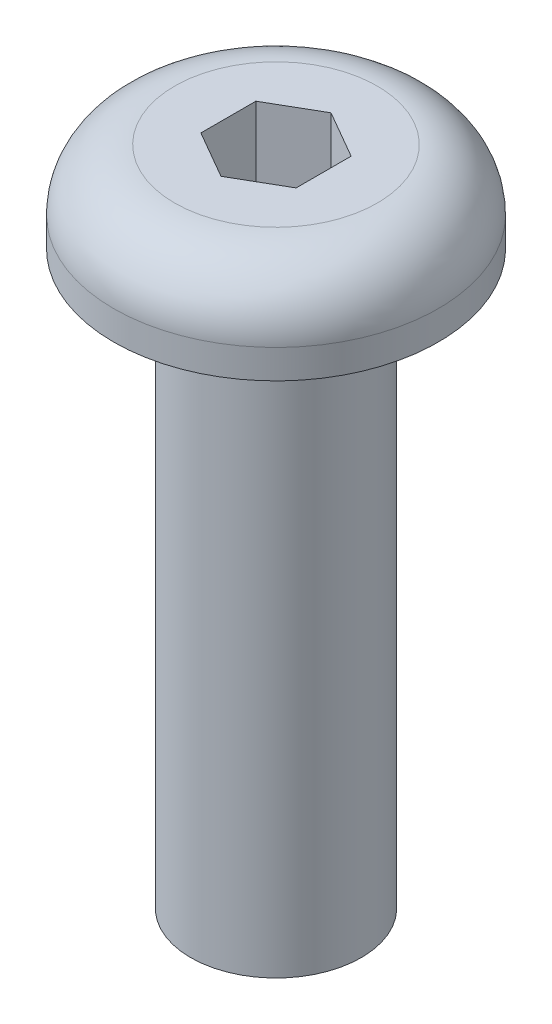
ISO-10303-21;
HEADER;
FILE_DESCRIPTION(('STEP AP214'),'2;1');
FILE_NAME('part.step','',(''),(''),'','','');
FILE_SCHEMA(('AUTOMOTIVE_DESIGN { 1 0 10303 214 1 1 1 1 }'));
ENDSEC;
DATA;
#1=APPLICATION_CONTEXT('core data for automotive mechanical design processes');
#2=APPLICATION_PROTOCOL_DEFINITION('international standard','automotive_design',2000,#1);
#3=PRODUCT_CONTEXT('',#1,'mechanical');
#4=PRODUCT('Part','Part','',(#3));
#5=PRODUCT_RELATED_PRODUCT_CATEGORY('part','',(#4));
#6=PRODUCT_DEFINITION_FORMATION('','',#4);
#7=PRODUCT_DEFINITION_CONTEXT('part definition',#1,'design');
#8=PRODUCT_DEFINITION('design','',#6,#7);
#9=PRODUCT_DEFINITION_SHAPE('','',#8);
#10=(LENGTH_UNIT() NAMED_UNIT(*) SI_UNIT(.MILLI.,.METRE.));
#11=(NAMED_UNIT(*) PLANE_ANGLE_UNIT() SI_UNIT($,.RADIAN.));
#12=(NAMED_UNIT(*) SI_UNIT($,.STERADIAN.) SOLID_ANGLE_UNIT());
#13=UNCERTAINTY_MEASURE_WITH_UNIT(LENGTH_MEASURE(1.E-05),#10,'distance_accuracy_value','');
#14=(GEOMETRIC_REPRESENTATION_CONTEXT(3) GLOBAL_UNCERTAINTY_ASSIGNED_CONTEXT((#13)) GLOBAL_UNIT_ASSIGNED_CONTEXT((#10,
#11,#12)) REPRESENTATION_CONTEXT('',''));
#15=CARTESIAN_POINT('',(0.,0.,0.));
#16=DIRECTION('',(0.,0.,1.));
#17=DIRECTION('',(1.,0.,0.));
#18=AXIS2_PLACEMENT_3D('',#15,#16,#17);
#19=CARTESIAN_POINT('',(0.,9.525,0.));
#20=DIRECTION('',(0.,-1.,0.));
#21=DIRECTION('',(0.,0.,-1.));
#22=AXIS2_PLACEMENT_3D('',#19,#20,#21);
#23=CYLINDRICAL_SURFACE('',#22,1.4224);
#24=CARTESIAN_POINT('',(0.,9.525,0.));
#25=DIRECTION('',(0.,1.,0.));
#26=DIRECTION('',(0.,0.,1.));
#27=AXIS2_PLACEMENT_3D('',#24,#25,#26);
#28=CIRCLE('',#27,1.4224);
#29=CARTESIAN_POINT('',(0.,9.525,1.4224));
#30=VERTEX_POINT('',#29);
#31=EDGE_CURVE('E143',#30,#30,#28,.T.);
#32=ORIENTED_EDGE('',*,*,#31,.F.);
#33=EDGE_LOOP('',(#32));
#34=FACE_BOUND('',#33,.T.);
#35=CARTESIAN_POINT('',(0.,0.,0.));
#36=DIRECTION('',(0.,1.,0.));
#37=DIRECTION('',(0.,0.,1.));
#38=AXIS2_PLACEMENT_3D('',#35,#36,#37);
#39=CIRCLE('',#38,1.4224);
#40=CARTESIAN_POINT('',(0.,0.,1.4224));
#41=VERTEX_POINT('',#40);
#42=EDGE_CURVE('E142',#41,#41,#39,.T.);
#43=ORIENTED_EDGE('',*,*,#42,.T.);
#44=EDGE_LOOP('',(#43));
#45=FACE_BOUND('',#44,.T.);
#46=ADVANCED_FACE('F32',(#34,#45),#23,.T.);
#47=CARTESIAN_POINT('',(0.,0.,0.));
#48=DIRECTION('',(0.,1.,0.));
#49=DIRECTION('',(0.,0.,1.));
#50=AXIS2_PLACEMENT_3D('',#47,#48,#49);
#51=PLANE('',#50);
#52=ORIENTED_EDGE('',*,*,#42,.F.);
#53=EDGE_LOOP('',(#52));
#54=FACE_BOUND('',#53,.T.);
#55=ADVANCED_FACE('F166',(#54),#51,.F.);
#56=CARTESIAN_POINT('',(0.,9.525,0.));
#57=DIRECTION('',(0.,1.,0.));
#58=DIRECTION('',(0.,0.,1.));
#59=AXIS2_PLACEMENT_3D('',#56,#57,#58);
#60=PLANE('',#59);
#61=CARTESIAN_POINT('',(0.,9.525,0.));
#62=DIRECTION('',(0.,1.,0.));
#63=DIRECTION('',(0.,0.,1.));
#64=AXIS2_PLACEMENT_3D('',#61,#62,#63);
#65=CIRCLE('',#64,2.7051);
#66=CARTESIAN_POINT('',(0.,9.525,2.7051));
#67=VERTEX_POINT('',#66);
#68=EDGE_CURVE('E134',#67,#67,#65,.T.);
#69=ORIENTED_EDGE('',*,*,#68,.F.);
#70=EDGE_LOOP('',(#69));
#71=FACE_BOUND('',#70,.T.);
#72=ORIENTED_EDGE('',*,*,#31,.T.);
#73=EDGE_LOOP('',(#72));
#74=FACE_BOUND('',#73,.T.);
#75=ADVANCED_FACE('F171',(#71,#74),#60,.F.);
#76=CARTESIAN_POINT('',(0.,11.0236,0.));
#77=DIRECTION('',(0.,-1.,0.));
#78=DIRECTION('',(0.,0.,-1.));
#79=AXIS2_PLACEMENT_3D('',#76,#77,#78);
#80=CYLINDRICAL_SURFACE('',#79,2.7051);
#81=CARTESIAN_POINT('',(0.,10.0076,0.));
#82=DIRECTION('',(0.,1.,0.));
#83=DIRECTION('',(0.,0.,1.));
#84=AXIS2_PLACEMENT_3D('',#81,#82,#83);
#85=CIRCLE('',#84,2.7051);
#86=CARTESIAN_POINT('',(0.,10.0076,2.7051));
#87=VERTEX_POINT('',#86);
#88=EDGE_CURVE('E11',#87,#87,#85,.F.);
#89=ORIENTED_EDGE('',*,*,#88,.T.);
#90=EDGE_LOOP('',(#89));
#91=FACE_BOUND('',#90,.T.);
#92=ORIENTED_EDGE('',*,*,#68,.T.);
#93=EDGE_LOOP('',(#92));
#94=FACE_BOUND('',#93,.T.);
#95=ADVANCED_FACE('F161',(#91,#94),#80,.T.);
#96=CARTESIAN_POINT('',(0.,11.0236,0.));
#97=DIRECTION('',(0.,1.,0.));
#98=DIRECTION('',(0.,0.,1.));
#99=AXIS2_PLACEMENT_3D('',#96,#97,#98);
#100=PLANE('',#99);
#101=DIRECTION('',(-0.866025403784438,0.,-0.5));
#102=VECTOR('',#101,1.);
#103=CARTESIAN_POINT('',(0.79375,11.0236,-0.458271776169266));
#104=LINE('',#103,#102);
#105=CARTESIAN_POINT('',(0.79375,11.0236,-0.458271776169266));
#106=VERTEX_POINT('',#105);
#107=CARTESIAN_POINT('',(0.,11.0236,-0.916543552338531));
#108=VERTEX_POINT('',#107);
#109=EDGE_CURVE('E47',#106,#108,#104,.T.);
#110=ORIENTED_EDGE('',*,*,#109,.F.);
#111=DIRECTION('',(0.,0.,-1.));
#112=VECTOR('',#111,1.);
#113=CARTESIAN_POINT('',(0.79375,11.0236,0.458271776169266));
#114=LINE('',#113,#112);
#115=CARTESIAN_POINT('',(0.79375,11.0236,0.458271776169266));
#116=VERTEX_POINT('',#115);
#117=EDGE_CURVE('E130',#116,#106,#114,.T.);
#118=ORIENTED_EDGE('',*,*,#117,.F.);
#119=DIRECTION('',(0.866025403784439,0.,-0.5));
#120=VECTOR('',#119,1.);
#121=CARTESIAN_POINT('',(0.,11.0236,0.916543552338531));
#122=LINE('',#121,#120);
#123=CARTESIAN_POINT('',(0.,11.0236,0.916543552338531));
#124=VERTEX_POINT('',#123);
#125=EDGE_CURVE('E128',#124,#116,#122,.T.);
#126=ORIENTED_EDGE('',*,*,#125,.F.);
#127=DIRECTION('',(0.866025403784439,0.,0.5));
#128=VECTOR('',#127,1.);
#129=CARTESIAN_POINT('',(-0.79375,11.0236,0.458271776169265));
#130=LINE('',#129,#128);
#131=CARTESIAN_POINT('',(-0.79375,11.0236,0.458271776169265));
#132=VERTEX_POINT('',#131);
#133=EDGE_CURVE('E95',#132,#124,#130,.T.);
#134=ORIENTED_EDGE('',*,*,#133,.F.);
#135=DIRECTION('',(0.,0.,1.));
#136=VECTOR('',#135,1.);
#137=CARTESIAN_POINT('',(-0.79375,11.0236,-0.458271776169265));
#138=LINE('',#137,#136);
#139=CARTESIAN_POINT('',(-0.79375,11.0236,-0.458271776169265));
#140=VERTEX_POINT('',#139);
#141=EDGE_CURVE('E124',#140,#132,#138,.T.);
#142=ORIENTED_EDGE('',*,*,#141,.F.);
#143=DIRECTION('',(-0.866025403784438,0.,0.5));
#144=VECTOR('',#143,1.);
#145=CARTESIAN_POINT('',(0.,11.0236,-0.916543552338531));
#146=LINE('',#145,#144);
#147=EDGE_CURVE('E121',#108,#140,#146,.T.);
#148=ORIENTED_EDGE('',*,*,#147,.F.);
#149=EDGE_LOOP('',(#110,#118,#126,#134,#142,#148));
#150=FACE_BOUND('',#149,.T.);
#151=CARTESIAN_POINT('',(0.,11.0236,0.));
#152=DIRECTION('',(0.,1.,0.));
#153=DIRECTION('',(0.,0.,1.));
#154=AXIS2_PLACEMENT_3D('',#151,#152,#153);
#155=CIRCLE('',#154,1.6891);
#156=CARTESIAN_POINT('',(0.,11.0236,1.6891));
#157=VERTEX_POINT('',#156);
#158=EDGE_CURVE('E40',#157,#157,#155,.T.);
#159=ORIENTED_EDGE('',*,*,#158,.T.);
#160=EDGE_LOOP('',(#159));
#161=FACE_BOUND('',#160,.T.);
#162=ADVANCED_FACE('F150',(#150,#161),#100,.T.);
#163=CARTESIAN_POINT('',(0.,10.0076,0.));
#164=DIRECTION('',(0.,1.,0.));
#165=DIRECTION('',(0.,0.,1.));
#166=AXIS2_PLACEMENT_3D('',#163,#164,#165);
#167=TOROIDAL_SURFACE('',#166,1.6891,1.016);
#168=ORIENTED_EDGE('',*,*,#88,.F.);
#169=EDGE_LOOP('',(#168));
#170=FACE_BOUND('',#169,.T.);
#171=ORIENTED_EDGE('',*,*,#158,.F.);
#172=EDGE_LOOP('',(#171));
#173=FACE_BOUND('',#172,.T.);
#174=ADVANCED_FACE('F34',(#170,#173),#167,.T.);
#175=CARTESIAN_POINT('',(0.79375,8.64235,-0.458271776169266));
#176=DIRECTION('',(0.5,0.,-0.866025403784439));
#177=DIRECTION('',(-0.866025403784438,0.,-0.5));
#178=AXIS2_PLACEMENT_3D('',#175,#176,#177);
#179=PLANE('',#178);
#180=ORIENTED_EDGE('',*,*,#109,.T.);
#181=DIRECTION('',(0.,1.,0.));
#182=VECTOR('',#181,1.);
#183=CARTESIAN_POINT('',(0.,8.64235,-0.916543552338531));
#184=LINE('',#183,#182);
#185=CARTESIAN_POINT('',(0.,8.64235,-0.916543552338531));
#186=VERTEX_POINT('',#185);
#187=EDGE_CURVE('E77',#186,#108,#184,.T.);
#188=ORIENTED_EDGE('',*,*,#187,.F.);
#189=DIRECTION('',(-0.866025403784438,0.,-0.5));
#190=VECTOR('',#189,1.);
#191=CARTESIAN_POINT('',(0.79375,8.64235,-0.458271776169266));
#192=LINE('',#191,#190);
#193=CARTESIAN_POINT('',(0.79375,8.64235,-0.458271776169266));
#194=VERTEX_POINT('',#193);
#195=EDGE_CURVE('E132',#194,#186,#192,.T.);
#196=ORIENTED_EDGE('',*,*,#195,.F.);
#197=DIRECTION('',(0.,1.,0.));
#198=VECTOR('',#197,1.);
#199=CARTESIAN_POINT('',(0.79375,8.64235,-0.458271776169266));
#200=LINE('',#199,#198);
#201=EDGE_CURVE('E55',#194,#106,#200,.T.);
#202=ORIENTED_EDGE('',*,*,#201,.T.);
#203=EDGE_LOOP('',(#180,#188,#196,#202));
#204=FACE_BOUND('',#203,.T.);
#205=ADVANCED_FACE('F153',(#204),#179,.F.);
#206=CARTESIAN_POINT('',(0.79375,8.64235,0.458271776169266));
#207=DIRECTION('',(1.,0.,0.));
#208=DIRECTION('',(0.,0.,-1.));
#209=AXIS2_PLACEMENT_3D('',#206,#207,#208);
#210=PLANE('',#209);
#211=ORIENTED_EDGE('',*,*,#117,.T.);
#212=ORIENTED_EDGE('',*,*,#201,.F.);
#213=DIRECTION('',(0.,0.,-1.));
#214=VECTOR('',#213,1.);
#215=CARTESIAN_POINT('',(0.79375,8.64235,0.458271776169266));
#216=LINE('',#215,#214);
#217=CARTESIAN_POINT('',(0.79375,8.64235,0.458271776169266));
#218=VERTEX_POINT('',#217);
#219=EDGE_CURVE('E107',#218,#194,#216,.T.);
#220=ORIENTED_EDGE('',*,*,#219,.F.);
#221=DIRECTION('',(0.,1.,0.));
#222=VECTOR('',#221,1.);
#223=CARTESIAN_POINT('',(0.79375,8.64235,0.458271776169266));
#224=LINE('',#223,#222);
#225=EDGE_CURVE('E99',#218,#116,#224,.T.);
#226=ORIENTED_EDGE('',*,*,#225,.T.);
#227=EDGE_LOOP('',(#211,#212,#220,#226));
#228=FACE_BOUND('',#227,.T.);
#229=ADVANCED_FACE('F159',(#228),#210,.F.);
#230=CARTESIAN_POINT('',(0.,8.64235,0.916543552338531));
#231=DIRECTION('',(0.5,0.,0.866025403784439));
#232=DIRECTION('',(0.866025403784439,0.,-0.5));
#233=AXIS2_PLACEMENT_3D('',#230,#231,#232);
#234=PLANE('',#233);
#235=ORIENTED_EDGE('',*,*,#125,.T.);
#236=ORIENTED_EDGE('',*,*,#225,.F.);
#237=DIRECTION('',(0.866025403784439,0.,-0.5));
#238=VECTOR('',#237,1.);
#239=CARTESIAN_POINT('',(0.,8.64235,0.916543552338531));
#240=LINE('',#239,#238);
#241=CARTESIAN_POINT('',(0.,8.64235,0.916543552338531));
#242=VERTEX_POINT('',#241);
#243=EDGE_CURVE('E103',#242,#218,#240,.T.);
#244=ORIENTED_EDGE('',*,*,#243,.F.);
#245=DIRECTION('',(0.,1.,0.));
#246=VECTOR('',#245,1.);
#247=CARTESIAN_POINT('',(0.,8.64235,0.916543552338531));
#248=LINE('',#247,#246);
#249=EDGE_CURVE('E88',#242,#124,#248,.T.);
#250=ORIENTED_EDGE('',*,*,#249,.T.);
#251=EDGE_LOOP('',(#235,#236,#244,#250));
#252=FACE_BOUND('',#251,.T.);
#253=ADVANCED_FACE('F104',(#252),#234,.F.);
#254=CARTESIAN_POINT('',(-0.79375,8.64235,0.458271776169265));
#255=DIRECTION('',(-0.5,0.,0.866025403784439));
#256=DIRECTION('',(0.866025403784438,0.,0.5));
#257=AXIS2_PLACEMENT_3D('',#254,#255,#256);
#258=PLANE('',#257);
#259=ORIENTED_EDGE('',*,*,#133,.T.);
#260=ORIENTED_EDGE('',*,*,#249,.F.);
#261=DIRECTION('',(0.866025403784439,0.,0.5));
#262=VECTOR('',#261,1.);
#263=CARTESIAN_POINT('',(-0.79375,8.64235,0.458271776169265));
#264=LINE('',#263,#262);
#265=CARTESIAN_POINT('',(-0.79375,8.64235,0.458271776169265));
#266=VERTEX_POINT('',#265);
#267=EDGE_CURVE('E92',#266,#242,#264,.T.);
#268=ORIENTED_EDGE('',*,*,#267,.F.);
#269=DIRECTION('',(0.,1.,0.));
#270=VECTOR('',#269,1.);
#271=CARTESIAN_POINT('',(-0.79375,8.64235,0.458271776169265));
#272=LINE('',#271,#270);
#273=EDGE_CURVE('E100',#266,#132,#272,.T.);
#274=ORIENTED_EDGE('',*,*,#273,.T.);
#275=EDGE_LOOP('',(#259,#260,#268,#274));
#276=FACE_BOUND('',#275,.T.);
#277=ADVANCED_FACE('F90',(#276),#258,.F.);
#278=CARTESIAN_POINT('',(-0.79375,8.64235,-0.458271776169265));
#279=DIRECTION('',(-1.,0.,0.));
#280=DIRECTION('',(0.,0.,1.));
#281=AXIS2_PLACEMENT_3D('',#278,#279,#280);
#282=PLANE('',#281);
#283=ORIENTED_EDGE('',*,*,#141,.T.);
#284=ORIENTED_EDGE('',*,*,#273,.F.);
#285=DIRECTION('',(0.,0.,1.));
#286=VECTOR('',#285,1.);
#287=CARTESIAN_POINT('',(-0.79375,8.64235,-0.458271776169265));
#288=LINE('',#287,#286);
#289=CARTESIAN_POINT('',(-0.79375,8.64235,-0.458271776169265));
#290=VERTEX_POINT('',#289);
#291=EDGE_CURVE('E113',#290,#266,#288,.T.);
#292=ORIENTED_EDGE('',*,*,#291,.F.);
#293=DIRECTION('',(0.,1.,0.));
#294=VECTOR('',#293,1.);
#295=CARTESIAN_POINT('',(-0.79375,8.64235,-0.458271776169265));
#296=LINE('',#295,#294);
#297=EDGE_CURVE('E137',#290,#140,#296,.T.);
#298=ORIENTED_EDGE('',*,*,#297,.T.);
#299=EDGE_LOOP('',(#283,#284,#292,#298));
#300=FACE_BOUND('',#299,.T.);
#301=ADVANCED_FACE('F186',(#300),#282,.F.);
#302=CARTESIAN_POINT('',(0.,8.64235,-0.916543552338531));
#303=DIRECTION('',(-0.5,0.,-0.866025403784439));
#304=DIRECTION('',(-0.866025403784438,0.,0.5));
#305=AXIS2_PLACEMENT_3D('',#302,#303,#304);
#306=PLANE('',#305);
#307=ORIENTED_EDGE('',*,*,#147,.T.);
#308=ORIENTED_EDGE('',*,*,#297,.F.);
#309=DIRECTION('',(-0.866025403784438,0.,0.5));
#310=VECTOR('',#309,1.);
#311=CARTESIAN_POINT('',(0.,8.64235,-0.916543552338531));
#312=LINE('',#311,#310);
#313=EDGE_CURVE('E115',#186,#290,#312,.T.);
#314=ORIENTED_EDGE('',*,*,#313,.F.);
#315=ORIENTED_EDGE('',*,*,#187,.T.);
#316=EDGE_LOOP('',(#307,#308,#314,#315));
#317=FACE_BOUND('',#316,.T.);
#318=ADVANCED_FACE('F183',(#317),#306,.F.);
#319=CARTESIAN_POINT('',(0.,8.64235,-0.916543552338531));
#320=DIRECTION('',(0.,1.,0.));
#321=DIRECTION('',(0.,0.,1.));
#322=AXIS2_PLACEMENT_3D('',#319,#320,#321);
#323=PLANE('',#322);
#324=ORIENTED_EDGE('',*,*,#195,.T.);
#325=ORIENTED_EDGE('',*,*,#313,.T.);
#326=ORIENTED_EDGE('',*,*,#291,.T.);
#327=ORIENTED_EDGE('',*,*,#267,.T.);
#328=ORIENTED_EDGE('',*,*,#243,.T.);
#329=ORIENTED_EDGE('',*,*,#219,.T.);
#330=EDGE_LOOP('',(#324,#325,#326,#327,#328,#329));
#331=FACE_BOUND('',#330,.T.);
#332=ADVANCED_FACE('F110',(#331),#323,.T.);
#333=CLOSED_SHELL('',(#46,#55,#75,#95,#162,#174,#205,#229,#253,#277,#301,#318,#332));
#334=MANIFOLD_SOLID_BREP('B2',#333);
#335=ADVANCED_BREP_SHAPE_REPRESENTATION('',(#18,#334),#14);
#336=SHAPE_DEFINITION_REPRESENTATION(#9,#335);
ENDSEC;
END-ISO-10303-21;
